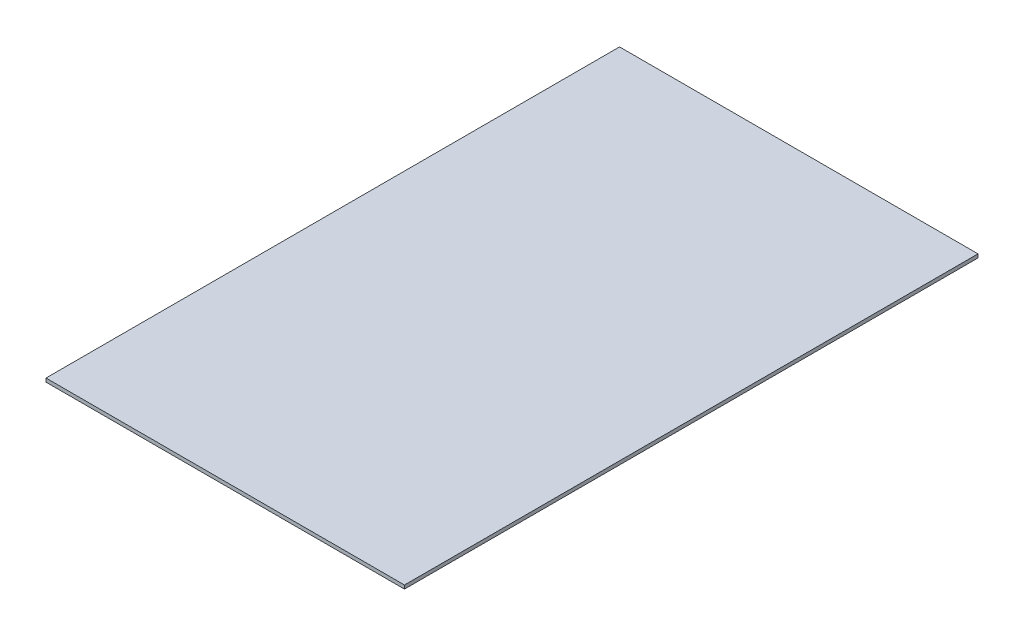
ISO-10303-21;
HEADER;
FILE_DESCRIPTION(('STEP AP214'),'2;1');
FILE_NAME('part.step','',(''),(''),'','','');
FILE_SCHEMA(('AUTOMOTIVE_DESIGN { 1 0 10303 214 1 1 1 1 }'));
ENDSEC;
DATA;
#1=APPLICATION_CONTEXT('core data for automotive mechanical design processes');
#2=APPLICATION_PROTOCOL_DEFINITION('international standard','automotive_design',2000,#1);
#3=PRODUCT_CONTEXT('',#1,'mechanical');
#4=PRODUCT('Part','Part','',(#3));
#5=PRODUCT_RELATED_PRODUCT_CATEGORY('part','',(#4));
#6=PRODUCT_DEFINITION_FORMATION('','',#4);
#7=PRODUCT_DEFINITION_CONTEXT('part definition',#1,'design');
#8=PRODUCT_DEFINITION('design','',#6,#7);
#9=PRODUCT_DEFINITION_SHAPE('','',#8);
#10=(LENGTH_UNIT() NAMED_UNIT(*) SI_UNIT(.MILLI.,.METRE.));
#11=(NAMED_UNIT(*) PLANE_ANGLE_UNIT() SI_UNIT($,.RADIAN.));
#12=(NAMED_UNIT(*) SI_UNIT($,.STERADIAN.) SOLID_ANGLE_UNIT());
#13=UNCERTAINTY_MEASURE_WITH_UNIT(LENGTH_MEASURE(1.E-05),#10,'distance_accuracy_value','');
#14=(GEOMETRIC_REPRESENTATION_CONTEXT(3) GLOBAL_UNCERTAINTY_ASSIGNED_CONTEXT((#13)) GLOBAL_UNIT_ASSIGNED_CONTEXT((#10,
#11,#12)) REPRESENTATION_CONTEXT('',''));
#15=CARTESIAN_POINT('',(0.,0.,0.));
#16=DIRECTION('',(0.,0.,1.));
#17=DIRECTION('',(1.,0.,0.));
#18=AXIS2_PLACEMENT_3D('',#15,#16,#17);
#19=CARTESIAN_POINT('',(-1358.10810810811,10.,-1542.56756756757));
#20=DIRECTION('',(-1.,0.,0.));
#21=DIRECTION('',(0.,0.,1.));
#22=AXIS2_PLACEMENT_3D('',#19,#20,#21);
#23=PLANE('',#22);
#24=DIRECTION('',(0.,0.,-1.));
#25=VECTOR('',#24,1.);
#26=CARTESIAN_POINT('',(-1358.10810810811,0.,-1542.56756756757));
#27=LINE('',#26,#25);
#28=CARTESIAN_POINT('',(-1358.10810810811,0.,57.4324324324323));
#29=VERTEX_POINT('',#28);
#30=CARTESIAN_POINT('',(-1358.10810810811,0.,-1542.56756756757));
#31=VERTEX_POINT('',#30);
#32=EDGE_CURVE('E107',#29,#31,#27,.T.);
#33=ORIENTED_EDGE('',*,*,#32,.T.);
#34=DIRECTION('',(0.,-1.,0.));
#35=VECTOR('',#34,1.);
#36=CARTESIAN_POINT('',(-1358.10810810811,10.,-1542.56756756757));
#37=LINE('',#36,#35);
#38=CARTESIAN_POINT('',(-1358.10810810811,10.,-1542.56756756757));
#39=VERTEX_POINT('',#38);
#40=EDGE_CURVE('E11',#39,#31,#37,.T.);
#41=ORIENTED_EDGE('',*,*,#40,.F.);
#42=DIRECTION('',(0.,0.,-1.));
#43=VECTOR('',#42,1.);
#44=CARTESIAN_POINT('',(-1358.10810810811,10.,-1542.56756756757));
#45=LINE('',#44,#43);
#46=CARTESIAN_POINT('',(-1358.10810810811,10.,57.4324324324323));
#47=VERTEX_POINT('',#46);
#48=EDGE_CURVE('E91',#47,#39,#45,.T.);
#49=ORIENTED_EDGE('',*,*,#48,.F.);
#50=DIRECTION('',(0.,-1.,0.));
#51=VECTOR('',#50,1.);
#52=CARTESIAN_POINT('',(-1358.10810810811,10.,57.4324324324323));
#53=LINE('',#52,#51);
#54=EDGE_CURVE('E103',#47,#29,#53,.T.);
#55=ORIENTED_EDGE('',*,*,#54,.T.);
#56=EDGE_LOOP('',(#33,#41,#49,#55));
#57=FACE_BOUND('',#56,.T.);
#58=ADVANCED_FACE('F39',(#57),#23,.F.);
#59=CARTESIAN_POINT('',(-2358.10810810811,10.,-1542.56756756757));
#60=DIRECTION('',(0.,0.,1.));
#61=DIRECTION('',(1.,0.,0.));
#62=AXIS2_PLACEMENT_3D('',#59,#60,#61);
#63=PLANE('',#62);
#64=DIRECTION('',(-1.,0.,0.));
#65=VECTOR('',#64,1.);
#66=CARTESIAN_POINT('',(-2358.10810810811,0.,-1542.56756756757));
#67=LINE('',#66,#65);
#68=CARTESIAN_POINT('',(-2358.10810810811,0.,-1542.56756756757));
#69=VERTEX_POINT('',#68);
#70=EDGE_CURVE('E96',#31,#69,#67,.T.);
#71=ORIENTED_EDGE('',*,*,#70,.T.);
#72=DIRECTION('',(0.,-1.,0.));
#73=VECTOR('',#72,1.);
#74=CARTESIAN_POINT('',(-2358.10810810811,10.,-1542.56756756757));
#75=LINE('',#74,#73);
#76=CARTESIAN_POINT('',(-2358.10810810811,10.,-1542.56756756757));
#77=VERTEX_POINT('',#76);
#78=EDGE_CURVE('E48',#77,#69,#75,.T.);
#79=ORIENTED_EDGE('',*,*,#78,.F.);
#80=DIRECTION('',(-1.,0.,0.));
#81=VECTOR('',#80,1.);
#82=CARTESIAN_POINT('',(-2358.10810810811,10.,-1542.56756756757));
#83=LINE('',#82,#81);
#84=EDGE_CURVE('E86',#39,#77,#83,.T.);
#85=ORIENTED_EDGE('',*,*,#84,.F.);
#86=ORIENTED_EDGE('',*,*,#40,.T.);
#87=EDGE_LOOP('',(#71,#79,#85,#86));
#88=FACE_BOUND('',#87,.T.);
#89=ADVANCED_FACE('F95',(#88),#63,.F.);
#90=CARTESIAN_POINT('',(-2358.10810810811,10.,-1542.56756756757));
#91=DIRECTION('',(1.,0.,0.));
#92=DIRECTION('',(0.,0.,-1.));
#93=AXIS2_PLACEMENT_3D('',#90,#91,#92);
#94=PLANE('',#93);
#95=DIRECTION('',(0.,0.,1.));
#96=VECTOR('',#95,1.);
#97=CARTESIAN_POINT('',(-2358.10810810811,0.,-1542.56756756757));
#98=LINE('',#97,#96);
#99=CARTESIAN_POINT('',(-2358.10810810811,0.,57.4324324324323));
#100=VERTEX_POINT('',#99);
#101=EDGE_CURVE('E73',#69,#100,#98,.T.);
#102=ORIENTED_EDGE('',*,*,#101,.T.);
#103=DIRECTION('',(0.,-1.,0.));
#104=VECTOR('',#103,1.);
#105=CARTESIAN_POINT('',(-2358.10810810811,10.,57.4324324324323));
#106=LINE('',#105,#104);
#107=CARTESIAN_POINT('',(-2358.10810810811,10.,57.4324324324323));
#108=VERTEX_POINT('',#107);
#109=EDGE_CURVE('E98',#108,#100,#106,.T.);
#110=ORIENTED_EDGE('',*,*,#109,.F.);
#111=DIRECTION('',(0.,0.,1.));
#112=VECTOR('',#111,1.);
#113=CARTESIAN_POINT('',(-2358.10810810811,10.,-1542.56756756757));
#114=LINE('',#113,#112);
#115=EDGE_CURVE('E89',#77,#108,#114,.T.);
#116=ORIENTED_EDGE('',*,*,#115,.F.);
#117=ORIENTED_EDGE('',*,*,#78,.T.);
#118=EDGE_LOOP('',(#102,#110,#116,#117));
#119=FACE_BOUND('',#118,.T.);
#120=ADVANCED_FACE('F99',(#119),#94,.F.);
#121=CARTESIAN_POINT('',(-2358.10810810811,10.,57.4324324324323));
#122=DIRECTION('',(0.,0.,-1.));
#123=DIRECTION('',(-1.,0.,0.));
#124=AXIS2_PLACEMENT_3D('',#121,#122,#123);
#125=PLANE('',#124);
#126=DIRECTION('',(1.,0.,0.));
#127=VECTOR('',#126,1.);
#128=CARTESIAN_POINT('',(-2358.10810810811,0.,57.4324324324323));
#129=LINE('',#128,#127);
#130=EDGE_CURVE('E79',#100,#29,#129,.T.);
#131=ORIENTED_EDGE('',*,*,#130,.T.);
#132=ORIENTED_EDGE('',*,*,#54,.F.);
#133=DIRECTION('',(1.,0.,0.));
#134=VECTOR('',#133,1.);
#135=CARTESIAN_POINT('',(-2358.10810810811,10.,57.4324324324323));
#136=LINE('',#135,#134);
#137=EDGE_CURVE('E56',#108,#47,#136,.T.);
#138=ORIENTED_EDGE('',*,*,#137,.F.);
#139=ORIENTED_EDGE('',*,*,#109,.T.);
#140=EDGE_LOOP('',(#131,#132,#138,#139));
#141=FACE_BOUND('',#140,.T.);
#142=ADVANCED_FACE('F120',(#141),#125,.F.);
#143=CARTESIAN_POINT('',(0.,10.,0.));
#144=DIRECTION('',(0.,1.,0.));
#145=DIRECTION('',(0.,0.,1.));
#146=AXIS2_PLACEMENT_3D('',#143,#144,#145);
#147=PLANE('',#146);
#148=ORIENTED_EDGE('',*,*,#48,.T.);
#149=ORIENTED_EDGE('',*,*,#84,.T.);
#150=ORIENTED_EDGE('',*,*,#115,.T.);
#151=ORIENTED_EDGE('',*,*,#137,.T.);
#152=EDGE_LOOP('',(#148,#149,#150,#151));
#153=FACE_BOUND('',#152,.T.);
#154=ADVANCED_FACE('F87',(#153),#147,.T.);
#155=CARTESIAN_POINT('',(0.,0.,0.));
#156=DIRECTION('',(0.,1.,0.));
#157=DIRECTION('',(0.,0.,1.));
#158=AXIS2_PLACEMENT_3D('',#155,#156,#157);
#159=PLANE('',#158);
#160=ORIENTED_EDGE('',*,*,#32,.F.);
#161=ORIENTED_EDGE('',*,*,#130,.F.);
#162=ORIENTED_EDGE('',*,*,#101,.F.);
#163=ORIENTED_EDGE('',*,*,#70,.F.);
#164=EDGE_LOOP('',(#160,#161,#162,#163));
#165=FACE_BOUND('',#164,.T.);
#166=ADVANCED_FACE('F123',(#165),#159,.F.);
#167=CLOSED_SHELL('',(#58,#89,#120,#142,#154,#166));
#168=MANIFOLD_SOLID_BREP('B2',#167);
#169=ADVANCED_BREP_SHAPE_REPRESENTATION('',(#18,#168),#14);
#170=SHAPE_DEFINITION_REPRESENTATION(#9,#169);
ENDSEC;
END-ISO-10303-21;
